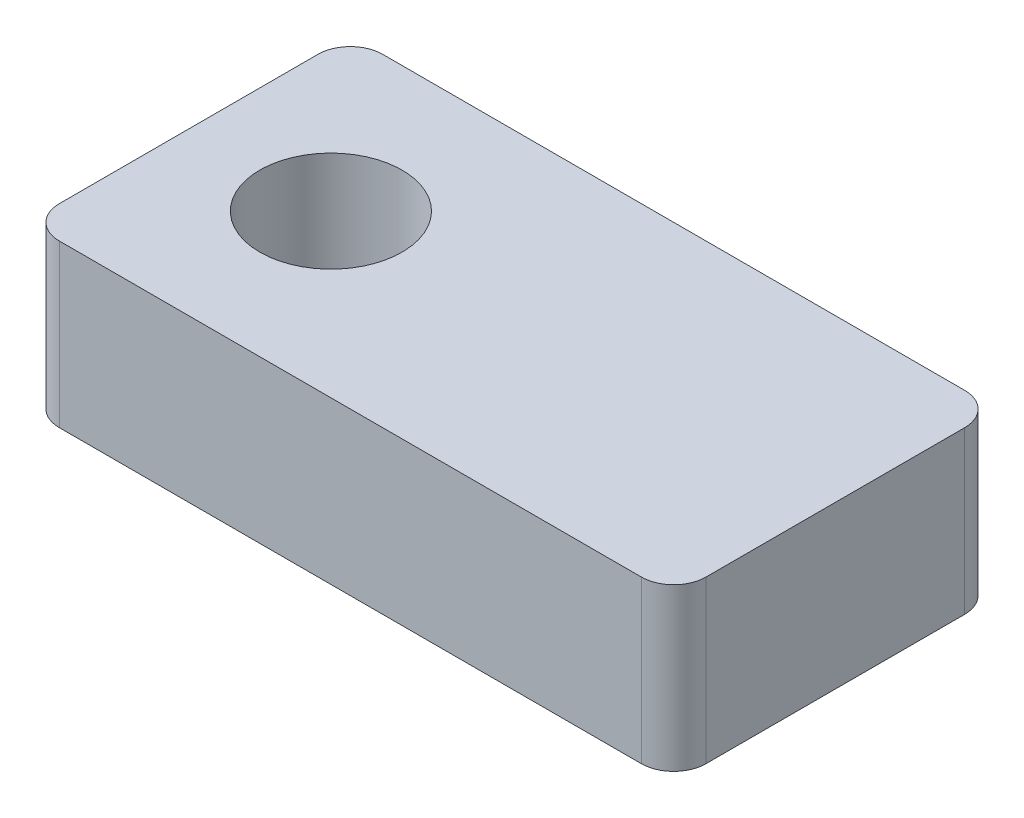
ISO-10303-21;
HEADER;
FILE_DESCRIPTION(('STEP AP214'),'2;1');
FILE_NAME('part.step','',(''),(''),'','','');
FILE_SCHEMA(('AUTOMOTIVE_DESIGN { 1 0 10303 214 1 1 1 1 }'));
ENDSEC;
DATA;
#1=APPLICATION_CONTEXT('core data for automotive mechanical design processes');
#2=APPLICATION_PROTOCOL_DEFINITION('international standard','automotive_design',2000,#1);
#3=PRODUCT_CONTEXT('',#1,'mechanical');
#4=PRODUCT('Part','Part','',(#3));
#5=PRODUCT_RELATED_PRODUCT_CATEGORY('part','',(#4));
#6=PRODUCT_DEFINITION_FORMATION('','',#4);
#7=PRODUCT_DEFINITION_CONTEXT('part definition',#1,'design');
#8=PRODUCT_DEFINITION('design','',#6,#7);
#9=PRODUCT_DEFINITION_SHAPE('','',#8);
#10=(LENGTH_UNIT() NAMED_UNIT(*) SI_UNIT(.MILLI.,.METRE.));
#11=(NAMED_UNIT(*) PLANE_ANGLE_UNIT() SI_UNIT($,.RADIAN.));
#12=(NAMED_UNIT(*) SI_UNIT($,.STERADIAN.) SOLID_ANGLE_UNIT());
#13=UNCERTAINTY_MEASURE_WITH_UNIT(LENGTH_MEASURE(1.E-05),#10,'distance_accuracy_value','');
#14=(GEOMETRIC_REPRESENTATION_CONTEXT(3) GLOBAL_UNCERTAINTY_ASSIGNED_CONTEXT((#13)) GLOBAL_UNIT_ASSIGNED_CONTEXT((#10,
#11,#12)) REPRESENTATION_CONTEXT('',''));
#15=CARTESIAN_POINT('',(0.,0.,0.));
#16=DIRECTION('',(0.,0.,1.));
#17=DIRECTION('',(1.,0.,0.));
#18=AXIS2_PLACEMENT_3D('',#15,#16,#17);
#19=CARTESIAN_POINT('',(0.,2.5,0.));
#20=DIRECTION('',(0.,-1.,0.));
#21=DIRECTION('',(0.,0.,-1.));
#22=AXIS2_PLACEMENT_3D('',#19,#20,#21);
#23=PLANE('',#22);
#24=DIRECTION('',(1.,0.,0.));
#25=VECTOR('',#24,1.);
#26=CARTESIAN_POINT('',(-5.,2.5,2.5));
#27=LINE('',#26,#25);
#28=CARTESIAN_POINT('',(-4.5,2.5,2.5));
#29=VERTEX_POINT('',#28);
#30=CARTESIAN_POINT('',(4.5,2.5,2.5));
#31=VERTEX_POINT('',#30);
#32=EDGE_CURVE('E136',#29,#31,#27,.T.);
#33=ORIENTED_EDGE('',*,*,#32,.T.);
#34=CARTESIAN_POINT('',(4.5,2.5,2.));
#35=DIRECTION('',(0.,-1.,0.));
#36=DIRECTION('',(0.,0.,-1.));
#37=AXIS2_PLACEMENT_3D('',#34,#35,#36);
#38=CIRCLE('',#37,0.5);
#39=CARTESIAN_POINT('',(5.,2.5,2.));
#40=VERTEX_POINT('',#39);
#41=EDGE_CURVE('E155',#31,#40,#38,.F.);
#42=ORIENTED_EDGE('',*,*,#41,.T.);
#43=DIRECTION('',(0.,0.,-1.));
#44=VECTOR('',#43,1.);
#45=CARTESIAN_POINT('',(5.,2.5,2.5));
#46=LINE('',#45,#44);
#47=CARTESIAN_POINT('',(5.,2.5,-2.));
#48=VERTEX_POINT('',#47);
#49=EDGE_CURVE('E119',#40,#48,#46,.T.);
#50=ORIENTED_EDGE('',*,*,#49,.T.);
#51=CARTESIAN_POINT('',(4.5,2.5,-2.));
#52=DIRECTION('',(0.,-1.,0.));
#53=DIRECTION('',(0.,0.,-1.));
#54=AXIS2_PLACEMENT_3D('',#51,#52,#53);
#55=CIRCLE('',#54,0.5);
#56=CARTESIAN_POINT('',(4.5,2.5,-2.5));
#57=VERTEX_POINT('',#56);
#58=EDGE_CURVE('E153',#48,#57,#55,.F.);
#59=ORIENTED_EDGE('',*,*,#58,.T.);
#60=DIRECTION('',(-1.,0.,0.));
#61=VECTOR('',#60,1.);
#62=CARTESIAN_POINT('',(-5.,2.5,-2.5));
#63=LINE('',#62,#61);
#64=CARTESIAN_POINT('',(-4.5,2.5,-2.5));
#65=VERTEX_POINT('',#64);
#66=EDGE_CURVE('E166',#57,#65,#63,.T.);
#67=ORIENTED_EDGE('',*,*,#66,.T.);
#68=CARTESIAN_POINT('',(-4.5,2.5,-2.));
#69=DIRECTION('',(0.,-1.,0.));
#70=DIRECTION('',(0.,0.,-1.));
#71=AXIS2_PLACEMENT_3D('',#68,#69,#70);
#72=CIRCLE('',#71,0.5);
#73=CARTESIAN_POINT('',(-5.,2.5,-2.));
#74=VERTEX_POINT('',#73);
#75=EDGE_CURVE('E54',#65,#74,#72,.F.);
#76=ORIENTED_EDGE('',*,*,#75,.T.);
#77=DIRECTION('',(0.,0.,1.));
#78=VECTOR('',#77,1.);
#79=CARTESIAN_POINT('',(-5.,2.5,2.5));
#80=LINE('',#79,#78);
#81=CARTESIAN_POINT('',(-5.,2.5,2.));
#82=VERTEX_POINT('',#81);
#83=EDGE_CURVE('E174',#74,#82,#80,.T.);
#84=ORIENTED_EDGE('',*,*,#83,.T.);
#85=CARTESIAN_POINT('',(-4.5,2.5,2.));
#86=DIRECTION('',(0.,-1.,0.));
#87=DIRECTION('',(0.,0.,-1.));
#88=AXIS2_PLACEMENT_3D('',#85,#86,#87);
#89=CIRCLE('',#88,0.5);
#90=EDGE_CURVE('E150',#82,#29,#89,.F.);
#91=ORIENTED_EDGE('',*,*,#90,.T.);
#92=EDGE_LOOP('',(#33,#42,#50,#59,#67,#76,#84,#91));
#93=FACE_BOUND('',#92,.T.);
#94=CARTESIAN_POINT('',(-2.8,2.5,0.));
#95=DIRECTION('',(0.,1.,0.));
#96=DIRECTION('',(0.,0.,1.));
#97=AXIS2_PLACEMENT_3D('',#94,#95,#96);
#98=CIRCLE('',#97,1.1);
#99=CARTESIAN_POINT('',(-2.8,2.5,1.1));
#100=VERTEX_POINT('',#99);
#101=EDGE_CURVE('E127',#100,#100,#98,.T.);
#102=ORIENTED_EDGE('',*,*,#101,.F.);
#103=EDGE_LOOP('',(#102));
#104=FACE_BOUND('',#103,.T.);
#105=ADVANCED_FACE('F33',(#93,#104),#23,.F.);
#106=CARTESIAN_POINT('',(0.,0.,0.));
#107=DIRECTION('',(0.,-1.,0.));
#108=DIRECTION('',(0.,0.,-1.));
#109=AXIS2_PLACEMENT_3D('',#106,#107,#108);
#110=PLANE('',#109);
#111=DIRECTION('',(0.,0.,-1.));
#112=VECTOR('',#111,1.);
#113=CARTESIAN_POINT('',(5.,0.,2.5));
#114=LINE('',#113,#112);
#115=CARTESIAN_POINT('',(5.,0.,2.));
#116=VERTEX_POINT('',#115);
#117=CARTESIAN_POINT('',(5.,0.,-2.));
#118=VERTEX_POINT('',#117);
#119=EDGE_CURVE('E116',#116,#118,#114,.T.);
#120=ORIENTED_EDGE('',*,*,#119,.F.);
#121=CARTESIAN_POINT('',(4.5,0.,2.));
#122=DIRECTION('',(0.,-1.,0.));
#123=DIRECTION('',(0.,0.,-1.));
#124=AXIS2_PLACEMENT_3D('',#121,#122,#123);
#125=CIRCLE('',#124,0.5);
#126=CARTESIAN_POINT('',(4.5,0.,2.5));
#127=VERTEX_POINT('',#126);
#128=EDGE_CURVE('E99',#116,#127,#125,.T.);
#129=ORIENTED_EDGE('',*,*,#128,.T.);
#130=DIRECTION('',(1.,0.,0.));
#131=VECTOR('',#130,1.);
#132=CARTESIAN_POINT('',(-5.,0.,2.5));
#133=LINE('',#132,#131);
#134=CARTESIAN_POINT('',(-4.5,0.,2.5));
#135=VERTEX_POINT('',#134);
#136=EDGE_CURVE('E140',#135,#127,#133,.T.);
#137=ORIENTED_EDGE('',*,*,#136,.F.);
#138=CARTESIAN_POINT('',(-4.5,0.,2.));
#139=DIRECTION('',(0.,-1.,0.));
#140=DIRECTION('',(0.,0.,-1.));
#141=AXIS2_PLACEMENT_3D('',#138,#139,#140);
#142=CIRCLE('',#141,0.5);
#143=CARTESIAN_POINT('',(-5.,0.,2.));
#144=VERTEX_POINT('',#143);
#145=EDGE_CURVE('E120',#135,#144,#142,.T.);
#146=ORIENTED_EDGE('',*,*,#145,.T.);
#147=DIRECTION('',(0.,0.,1.));
#148=VECTOR('',#147,1.);
#149=CARTESIAN_POINT('',(-5.,0.,2.5));
#150=LINE('',#149,#148);
#151=CARTESIAN_POINT('',(-5.,0.,-2.));
#152=VERTEX_POINT('',#151);
#153=EDGE_CURVE('E130',#152,#144,#150,.T.);
#154=ORIENTED_EDGE('',*,*,#153,.F.);
#155=CARTESIAN_POINT('',(-4.5,0.,-2.));
#156=DIRECTION('',(0.,-1.,0.));
#157=DIRECTION('',(0.,0.,-1.));
#158=AXIS2_PLACEMENT_3D('',#155,#156,#157);
#159=CIRCLE('',#158,0.5);
#160=CARTESIAN_POINT('',(-4.5,0.,-2.5));
#161=VERTEX_POINT('',#160);
#162=EDGE_CURVE('E144',#152,#161,#159,.T.);
#163=ORIENTED_EDGE('',*,*,#162,.T.);
#164=DIRECTION('',(-1.,0.,0.));
#165=VECTOR('',#164,1.);
#166=CARTESIAN_POINT('',(-5.,0.,-2.5));
#167=LINE('',#166,#165);
#168=CARTESIAN_POINT('',(4.5,0.,-2.5));
#169=VERTEX_POINT('',#168);
#170=EDGE_CURVE('E126',#169,#161,#167,.T.);
#171=ORIENTED_EDGE('',*,*,#170,.F.);
#172=CARTESIAN_POINT('',(4.5,0.,-2.));
#173=DIRECTION('',(0.,-1.,0.));
#174=DIRECTION('',(0.,0.,-1.));
#175=AXIS2_PLACEMENT_3D('',#172,#173,#174);
#176=CIRCLE('',#175,0.5);
#177=EDGE_CURVE('E110',#169,#118,#176,.T.);
#178=ORIENTED_EDGE('',*,*,#177,.T.);
#179=EDGE_LOOP('',(#120,#129,#137,#146,#154,#163,#171,#178));
#180=FACE_BOUND('',#179,.T.);
#181=CARTESIAN_POINT('',(-2.8,0.,0.));
#182=DIRECTION('',(0.,1.,0.));
#183=DIRECTION('',(0.,0.,1.));
#184=AXIS2_PLACEMENT_3D('',#181,#182,#183);
#185=CIRCLE('',#184,1.1);
#186=CARTESIAN_POINT('',(-2.8,0.,1.1));
#187=VERTEX_POINT('',#186);
#188=EDGE_CURVE('E133',#187,#187,#185,.T.);
#189=ORIENTED_EDGE('',*,*,#188,.T.);
#190=EDGE_LOOP('',(#189));
#191=FACE_BOUND('',#190,.T.);
#192=ADVANCED_FACE('F123',(#180,#191),#110,.T.);
#193=CARTESIAN_POINT('',(5.,2.5,2.5));
#194=DIRECTION('',(-1.,0.,0.));
#195=DIRECTION('',(0.,0.,1.));
#196=AXIS2_PLACEMENT_3D('',#193,#194,#195);
#197=PLANE('',#196);
#198=ORIENTED_EDGE('',*,*,#49,.F.);
#199=DIRECTION('',(0.,-1.,0.));
#200=VECTOR('',#199,1.);
#201=CARTESIAN_POINT('',(5.,2.5,2.));
#202=LINE('',#201,#200);
#203=EDGE_CURVE('E103',#40,#116,#202,.T.);
#204=ORIENTED_EDGE('',*,*,#203,.T.);
#205=ORIENTED_EDGE('',*,*,#119,.T.);
#206=DIRECTION('',(0.,-1.,0.));
#207=VECTOR('',#206,1.);
#208=CARTESIAN_POINT('',(5.,2.5,-2.));
#209=LINE('',#208,#207);
#210=EDGE_CURVE('E121',#118,#48,#209,.F.);
#211=ORIENTED_EDGE('',*,*,#210,.T.);
#212=EDGE_LOOP('',(#198,#204,#205,#211));
#213=FACE_BOUND('',#212,.T.);
#214=ADVANCED_FACE('F115',(#213),#197,.F.);
#215=CARTESIAN_POINT('',(-5.,2.5,-2.5));
#216=DIRECTION('',(0.,0.,1.));
#217=DIRECTION('',(1.,0.,0.));
#218=AXIS2_PLACEMENT_3D('',#215,#216,#217);
#219=PLANE('',#218);
#220=ORIENTED_EDGE('',*,*,#66,.F.);
#221=DIRECTION('',(0.,-1.,0.));
#222=VECTOR('',#221,1.);
#223=CARTESIAN_POINT('',(4.5,2.5,-2.5));
#224=LINE('',#223,#222);
#225=EDGE_CURVE('E159',#57,#169,#224,.T.);
#226=ORIENTED_EDGE('',*,*,#225,.T.);
#227=ORIENTED_EDGE('',*,*,#170,.T.);
#228=DIRECTION('',(0.,-1.,0.));
#229=VECTOR('',#228,1.);
#230=CARTESIAN_POINT('',(-4.5,2.5,-2.5));
#231=LINE('',#230,#229);
#232=EDGE_CURVE('E157',#161,#65,#231,.F.);
#233=ORIENTED_EDGE('',*,*,#232,.T.);
#234=EDGE_LOOP('',(#220,#226,#227,#233));
#235=FACE_BOUND('',#234,.T.);
#236=ADVANCED_FACE('F164',(#235),#219,.F.);
#237=CARTESIAN_POINT('',(-5.,2.5,2.5));
#238=DIRECTION('',(1.,0.,0.));
#239=DIRECTION('',(0.,0.,-1.));
#240=AXIS2_PLACEMENT_3D('',#237,#238,#239);
#241=PLANE('',#240);
#242=ORIENTED_EDGE('',*,*,#83,.F.);
#243=DIRECTION('',(0.,-1.,0.));
#244=VECTOR('',#243,1.);
#245=CARTESIAN_POINT('',(-5.,2.5,-2.));
#246=LINE('',#245,#244);
#247=EDGE_CURVE('E11',#74,#152,#246,.T.);
#248=ORIENTED_EDGE('',*,*,#247,.T.);
#249=ORIENTED_EDGE('',*,*,#153,.T.);
#250=DIRECTION('',(0.,-1.,0.));
#251=VECTOR('',#250,1.);
#252=CARTESIAN_POINT('',(-5.,2.5,2.));
#253=LINE('',#252,#251);
#254=EDGE_CURVE('E41',#144,#82,#253,.F.);
#255=ORIENTED_EDGE('',*,*,#254,.T.);
#256=EDGE_LOOP('',(#242,#248,#249,#255));
#257=FACE_BOUND('',#256,.T.);
#258=ADVANCED_FACE('F173',(#257),#241,.F.);
#259=CARTESIAN_POINT('',(-5.,2.5,2.5));
#260=DIRECTION('',(0.,0.,-1.));
#261=DIRECTION('',(-1.,0.,0.));
#262=AXIS2_PLACEMENT_3D('',#259,#260,#261);
#263=PLANE('',#262);
#264=ORIENTED_EDGE('',*,*,#136,.T.);
#265=DIRECTION('',(0.,-1.,0.));
#266=VECTOR('',#265,1.);
#267=CARTESIAN_POINT('',(4.5,2.5,2.5));
#268=LINE('',#267,#266);
#269=EDGE_CURVE('E104',#127,#31,#268,.F.);
#270=ORIENTED_EDGE('',*,*,#269,.T.);
#271=ORIENTED_EDGE('',*,*,#32,.F.);
#272=DIRECTION('',(0.,-1.,0.));
#273=VECTOR('',#272,1.);
#274=CARTESIAN_POINT('',(-4.5,2.5,2.5));
#275=LINE('',#274,#273);
#276=EDGE_CURVE('E109',#29,#135,#275,.T.);
#277=ORIENTED_EDGE('',*,*,#276,.T.);
#278=EDGE_LOOP('',(#264,#270,#271,#277));
#279=FACE_BOUND('',#278,.T.);
#280=ADVANCED_FACE('F185',(#279),#263,.F.);
#281=CARTESIAN_POINT('',(-2.8,2.5,0.));
#282=DIRECTION('',(0.,-1.,0.));
#283=DIRECTION('',(0.,0.,-1.));
#284=AXIS2_PLACEMENT_3D('',#281,#282,#283);
#285=CYLINDRICAL_SURFACE('',#284,1.1);
#286=ORIENTED_EDGE('',*,*,#101,.T.);
#287=EDGE_LOOP('',(#286));
#288=FACE_BOUND('',#287,.T.);
#289=ORIENTED_EDGE('',*,*,#188,.F.);
#290=EDGE_LOOP('',(#289));
#291=FACE_BOUND('',#290,.T.);
#292=ADVANCED_FACE('F183',(#288,#291),#285,.F.);
#293=CARTESIAN_POINT('',(4.5,2.5,2.));
#294=DIRECTION('',(0.,-1.,0.));
#295=DIRECTION('',(0.,0.,-1.));
#296=AXIS2_PLACEMENT_3D('',#293,#294,#295);
#297=CYLINDRICAL_SURFACE('',#296,0.5);
#298=ORIENTED_EDGE('',*,*,#41,.F.);
#299=ORIENTED_EDGE('',*,*,#269,.F.);
#300=ORIENTED_EDGE('',*,*,#128,.F.);
#301=ORIENTED_EDGE('',*,*,#203,.F.);
#302=EDGE_LOOP('',(#298,#299,#300,#301));
#303=FACE_BOUND('',#302,.T.);
#304=ADVANCED_FACE('F102',(#303),#297,.T.);
#305=CARTESIAN_POINT('',(4.5,2.5,-2.));
#306=DIRECTION('',(0.,-1.,0.));
#307=DIRECTION('',(0.,0.,-1.));
#308=AXIS2_PLACEMENT_3D('',#305,#306,#307);
#309=CYLINDRICAL_SURFACE('',#308,0.5);
#310=ORIENTED_EDGE('',*,*,#58,.F.);
#311=ORIENTED_EDGE('',*,*,#210,.F.);
#312=ORIENTED_EDGE('',*,*,#177,.F.);
#313=ORIENTED_EDGE('',*,*,#225,.F.);
#314=EDGE_LOOP('',(#310,#311,#312,#313));
#315=FACE_BOUND('',#314,.T.);
#316=ADVANCED_FACE('F192',(#315),#309,.T.);
#317=CARTESIAN_POINT('',(-4.5,2.5,-2.));
#318=DIRECTION('',(0.,-1.,0.));
#319=DIRECTION('',(0.,0.,-1.));
#320=AXIS2_PLACEMENT_3D('',#317,#318,#319);
#321=CYLINDRICAL_SURFACE('',#320,0.5);
#322=ORIENTED_EDGE('',*,*,#75,.F.);
#323=ORIENTED_EDGE('',*,*,#232,.F.);
#324=ORIENTED_EDGE('',*,*,#162,.F.);
#325=ORIENTED_EDGE('',*,*,#247,.F.);
#326=EDGE_LOOP('',(#322,#323,#324,#325));
#327=FACE_BOUND('',#326,.T.);
#328=ADVANCED_FACE('F172',(#327),#321,.T.);
#329=CARTESIAN_POINT('',(-4.5,2.5,2.));
#330=DIRECTION('',(0.,-1.,0.));
#331=DIRECTION('',(0.,0.,-1.));
#332=AXIS2_PLACEMENT_3D('',#329,#330,#331);
#333=CYLINDRICAL_SURFACE('',#332,0.5);
#334=ORIENTED_EDGE('',*,*,#90,.F.);
#335=ORIENTED_EDGE('',*,*,#254,.F.);
#336=ORIENTED_EDGE('',*,*,#145,.F.);
#337=ORIENTED_EDGE('',*,*,#276,.F.);
#338=EDGE_LOOP('',(#334,#335,#336,#337));
#339=FACE_BOUND('',#338,.T.);
#340=ADVANCED_FACE('F35',(#339),#333,.T.);
#341=CLOSED_SHELL('',(#105,#192,#214,#236,#258,#280,#292,#304,#316,#328,#340));
#342=MANIFOLD_SOLID_BREP('B2',#341);
#343=ADVANCED_BREP_SHAPE_REPRESENTATION('',(#18,#342),#14);
#344=SHAPE_DEFINITION_REPRESENTATION(#9,#343);
ENDSEC;
END-ISO-10303-21;
